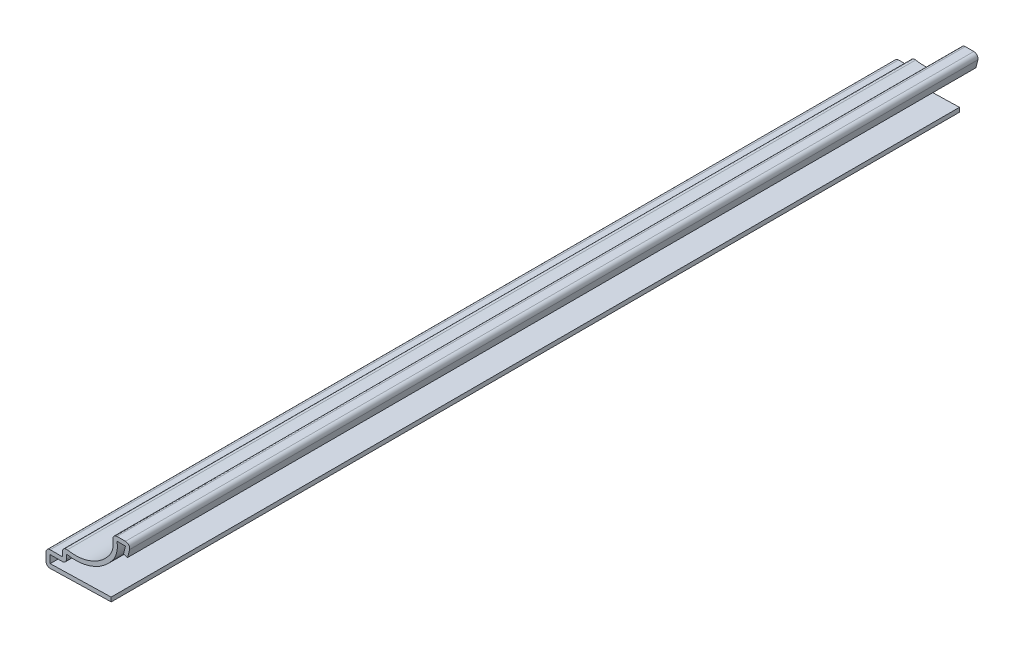
ISO-10303-21;
HEADER;
FILE_DESCRIPTION(('STEP AP214'),'2;1');
FILE_NAME('part.step','',(''),(''),'','','');
FILE_SCHEMA(('AUTOMOTIVE_DESIGN { 1 0 10303 214 1 1 1 1 }'));
ENDSEC;
DATA;
#1=APPLICATION_CONTEXT('core data for automotive mechanical design processes');
#2=APPLICATION_PROTOCOL_DEFINITION('international standard','automotive_design',2000,#1);
#3=PRODUCT_CONTEXT('',#1,'mechanical');
#4=PRODUCT('Part','Part','',(#3));
#5=PRODUCT_RELATED_PRODUCT_CATEGORY('part','',(#4));
#6=PRODUCT_DEFINITION_FORMATION('','',#4);
#7=PRODUCT_DEFINITION_CONTEXT('part definition',#1,'design');
#8=PRODUCT_DEFINITION('design','',#6,#7);
#9=PRODUCT_DEFINITION_SHAPE('','',#8);
#10=(LENGTH_UNIT() NAMED_UNIT(*) SI_UNIT(.MILLI.,.METRE.));
#11=(NAMED_UNIT(*) PLANE_ANGLE_UNIT() SI_UNIT($,.RADIAN.));
#12=(NAMED_UNIT(*) SI_UNIT($,.STERADIAN.) SOLID_ANGLE_UNIT());
#13=UNCERTAINTY_MEASURE_WITH_UNIT(LENGTH_MEASURE(1.E-05),#10,'distance_accuracy_value','');
#14=(GEOMETRIC_REPRESENTATION_CONTEXT(3) GLOBAL_UNCERTAINTY_ASSIGNED_CONTEXT((#13)) GLOBAL_UNIT_ASSIGNED_CONTEXT((#10,
#11,#12)) REPRESENTATION_CONTEXT('',''));
#15=CARTESIAN_POINT('',(0.,0.,0.));
#16=DIRECTION('',(0.,0.,1.));
#17=DIRECTION('',(1.,0.,0.));
#18=AXIS2_PLACEMENT_3D('',#15,#16,#17);
#19=CARTESIAN_POINT('',(-20.6375,0.,-206.375));
#20=DIRECTION('',(0.0249921911602031,-0.999687646408123,0.));
#21=DIRECTION('',(0.999687646408123,0.0249921911602031,0.));
#22=AXIS2_PLACEMENT_3D('',#19,#20,#21);
#23=PLANE('',#22);
#24=DIRECTION('',(0.999687646408123,0.0249921911602031,0.));
#25=VECTOR('',#24,1.);
#26=CARTESIAN_POINT('',(-20.6375,0.,0.));
#27=LINE('',#26,#25);
#28=CARTESIAN_POINT('',(-19.5961079337812,0.0260348016554691,0.));
#29=VERTEX_POINT('',#28);
#30=CARTESIAN_POINT('',(-4.7625,0.396875,0.));
#31=VERTEX_POINT('',#30);
#32=EDGE_CURVE('E360',#29,#31,#27,.T.);
#33=ORIENTED_EDGE('',*,*,#32,.F.);
#34=DIRECTION('',(0.,0.,1.));
#35=VECTOR('',#34,1.);
#36=CARTESIAN_POINT('',(-19.5961079337812,0.0260348016554691,-206.375));
#37=LINE('',#36,#35);
#38=CARTESIAN_POINT('',(-19.5961079337812,0.0260348016554691,-206.375));
#39=VERTEX_POINT('',#38);
#40=EDGE_CURVE('E205',#29,#39,#37,.F.);
#41=ORIENTED_EDGE('',*,*,#40,.T.);
#42=DIRECTION('',(0.999687646408123,0.0249921911602031,0.));
#43=VECTOR('',#42,1.);
#44=CARTESIAN_POINT('',(-20.6375,0.,-206.375));
#45=LINE('',#44,#43);
#46=CARTESIAN_POINT('',(-4.7625,0.396875,-206.375));
#47=VERTEX_POINT('',#46);
#48=EDGE_CURVE('E198',#39,#47,#45,.T.);
#49=ORIENTED_EDGE('',*,*,#48,.T.);
#50=DIRECTION('',(0.,0.,1.));
#51=VECTOR('',#50,1.);
#52=CARTESIAN_POINT('',(-4.7625,0.396875,-206.375));
#53=LINE('',#52,#51);
#54=EDGE_CURVE('E202',#47,#31,#53,.T.);
#55=ORIENTED_EDGE('',*,*,#54,.T.);
#56=EDGE_LOOP('',(#33,#41,#49,#55));
#57=FACE_BOUND('',#56,.T.);
#58=ADVANCED_FACE('F35',(#57),#23,.T.);
#59=CARTESIAN_POINT('',(-20.6375,3.96875,-206.375));
#60=DIRECTION('',(-1.,0.,0.));
#61=DIRECTION('',(0.,0.,1.));
#62=AXIS2_PLACEMENT_3D('',#59,#60,#61);
#63=PLANE('',#62);
#64=DIRECTION('',(0.,-1.,0.));
#65=VECTOR('',#64,1.);
#66=CARTESIAN_POINT('',(-20.6375,3.96875,-206.375));
#67=LINE('',#66,#65);
#68=CARTESIAN_POINT('',(-20.6375,2.95275,-206.375));
#69=VERTEX_POINT('',#68);
#70=CARTESIAN_POINT('',(-20.6375,1.04171745040612,-206.375));
#71=VERTEX_POINT('',#70);
#72=EDGE_CURVE('E222',#69,#71,#67,.T.);
#73=ORIENTED_EDGE('',*,*,#72,.T.);
#74=DIRECTION('',(0.,0.,1.));
#75=VECTOR('',#74,1.);
#76=CARTESIAN_POINT('',(-20.6375,1.04171745040612,-206.375));
#77=LINE('',#76,#75);
#78=CARTESIAN_POINT('',(-20.6375,1.04171745040612,0.));
#79=VERTEX_POINT('',#78);
#80=EDGE_CURVE('E233',#71,#79,#77,.T.);
#81=ORIENTED_EDGE('',*,*,#80,.T.);
#82=DIRECTION('',(0.,-1.,0.));
#83=VECTOR('',#82,1.);
#84=CARTESIAN_POINT('',(-20.6375,3.96875,0.));
#85=LINE('',#84,#83);
#86=CARTESIAN_POINT('',(-20.6375,2.95275,0.));
#87=VERTEX_POINT('',#86);
#88=EDGE_CURVE('E208',#87,#79,#85,.T.);
#89=ORIENTED_EDGE('',*,*,#88,.F.);
#90=DIRECTION('',(0.,0.,1.));
#91=VECTOR('',#90,1.);
#92=CARTESIAN_POINT('',(-20.6375,2.95275,-206.375));
#93=LINE('',#92,#91);
#94=EDGE_CURVE('E231',#87,#69,#93,.F.);
#95=ORIENTED_EDGE('',*,*,#94,.T.);
#96=EDGE_LOOP('',(#73,#81,#89,#95));
#97=FACE_BOUND('',#96,.T.);
#98=ADVANCED_FACE('F424',(#97),#63,.T.);
#99=CARTESIAN_POINT('',(-16.66875,3.96875,-206.375));
#100=DIRECTION('',(0.,1.,0.));
#101=DIRECTION('',(-1.,0.,0.));
#102=AXIS2_PLACEMENT_3D('',#99,#100,#101);
#103=PLANE('',#102);
#104=DIRECTION('',(-1.,0.,0.));
#105=VECTOR('',#104,1.);
#106=CARTESIAN_POINT('',(-16.66875,3.96875,-206.375));
#107=LINE('',#106,#105);
#108=CARTESIAN_POINT('',(-16.66875,3.96875,-206.375));
#109=VERTEX_POINT('',#108);
#110=CARTESIAN_POINT('',(-19.6215,3.96875,-206.375));
#111=VERTEX_POINT('',#110);
#112=EDGE_CURVE('E227',#109,#111,#107,.T.);
#113=ORIENTED_EDGE('',*,*,#112,.T.);
#114=DIRECTION('',(0.,0.,1.));
#115=VECTOR('',#114,1.);
#116=CARTESIAN_POINT('',(-19.6215,3.96875,-206.375));
#117=LINE('',#116,#115);
#118=CARTESIAN_POINT('',(-19.6215,3.96875,0.));
#119=VERTEX_POINT('',#118);
#120=EDGE_CURVE('E261',#111,#119,#117,.T.);
#121=ORIENTED_EDGE('',*,*,#120,.T.);
#122=DIRECTION('',(-1.,0.,0.));
#123=VECTOR('',#122,1.);
#124=CARTESIAN_POINT('',(-16.66875,3.96875,0.));
#125=LINE('',#124,#123);
#126=CARTESIAN_POINT('',(-16.66875,3.96875,0.));
#127=VERTEX_POINT('',#126);
#128=EDGE_CURVE('E319',#127,#119,#125,.T.);
#129=ORIENTED_EDGE('',*,*,#128,.F.);
#130=DIRECTION('',(0.,0.,1.));
#131=VECTOR('',#130,1.);
#132=CARTESIAN_POINT('',(-16.66875,3.96875,-206.375));
#133=LINE('',#132,#131);
#134=EDGE_CURVE('E234',#109,#127,#133,.T.);
#135=ORIENTED_EDGE('',*,*,#134,.F.);
#136=EDGE_LOOP('',(#113,#121,#129,#135));
#137=FACE_BOUND('',#136,.T.);
#138=ADVANCED_FACE('F434',(#137),#103,.T.);
#139=CARTESIAN_POINT('',(-16.66875,6.35,-206.375));
#140=DIRECTION('',(-1.,0.,0.));
#141=DIRECTION('',(0.,0.,1.));
#142=AXIS2_PLACEMENT_3D('',#139,#140,#141);
#143=PLANE('',#142);
#144=DIRECTION('',(0.,-1.,0.));
#145=VECTOR('',#144,1.);
#146=CARTESIAN_POINT('',(-16.66875,6.35,0.));
#147=LINE('',#146,#145);
#148=CARTESIAN_POINT('',(-16.66875,5.0409139638664,0.));
#149=VERTEX_POINT('',#148);
#150=EDGE_CURVE('E317',#149,#127,#147,.T.);
#151=ORIENTED_EDGE('',*,*,#150,.F.);
#152=DIRECTION('',(0.,0.,1.));
#153=VECTOR('',#152,1.);
#154=CARTESIAN_POINT('',(-16.66875,5.0409139638664,-206.375));
#155=LINE('',#154,#153);
#156=CARTESIAN_POINT('',(-16.66875,5.0409139638664,-206.375));
#157=VERTEX_POINT('',#156);
#158=EDGE_CURVE('E271',#149,#157,#155,.F.);
#159=ORIENTED_EDGE('',*,*,#158,.T.);
#160=DIRECTION('',(0.,-1.,0.));
#161=VECTOR('',#160,1.);
#162=CARTESIAN_POINT('',(-16.66875,6.35,-206.375));
#163=LINE('',#162,#161);
#164=EDGE_CURVE('E415',#157,#109,#163,.T.);
#165=ORIENTED_EDGE('',*,*,#164,.T.);
#166=ORIENTED_EDGE('',*,*,#134,.T.);
#167=EDGE_LOOP('',(#151,#159,#165,#166));
#168=FACE_BOUND('',#167,.T.);
#169=ADVANCED_FACE('F438',(#168),#143,.T.);
#170=CARTESIAN_POINT('',(-13.49375,16.1681452710021,-206.375));
#171=DIRECTION('',(0.,0.,1.));
#172=DIRECTION('',(1.,0.,0.));
#173=AXIS2_PLACEMENT_3D('',#170,#171,#172);
#174=CYLINDRICAL_SURFACE('',#173,10.31875);
#175=CARTESIAN_POINT('',(-13.49375,16.1681452710021,-206.375));
#176=DIRECTION('',(0.,0.,-1.));
#177=DIRECTION('',(-1.,0.,0.));
#178=AXIS2_PLACEMENT_3D('',#175,#176,#177);
#179=CIRCLE('',#178,10.31875);
#180=CARTESIAN_POINT('',(-5.2407693577414,9.97420370839389,-206.375));
#181=VERTEX_POINT('',#180);
#182=CARTESIAN_POINT('',(-15.4592261904762,6.03831284853962,-206.375));
#183=VERTEX_POINT('',#182);
#184=EDGE_CURVE('E292',#181,#183,#179,.T.);
#185=ORIENTED_EDGE('',*,*,#184,.T.);
#186=DIRECTION('',(0.,0.,1.));
#187=VECTOR('',#186,1.);
#188=CARTESIAN_POINT('',(-15.4592261904762,6.03831284853962,-206.375));
#189=LINE('',#188,#187);
#190=CARTESIAN_POINT('',(-15.4592261904762,6.03831284853962,0.));
#191=VERTEX_POINT('',#190);
#192=EDGE_CURVE('E268',#183,#191,#189,.T.);
#193=ORIENTED_EDGE('',*,*,#192,.T.);
#194=CARTESIAN_POINT('',(-13.49375,16.1681452710021,0.));
#195=DIRECTION('',(0.,0.,-1.));
#196=DIRECTION('',(-1.,0.,0.));
#197=AXIS2_PLACEMENT_3D('',#194,#195,#196);
#198=CIRCLE('',#197,10.31875);
#199=CARTESIAN_POINT('',(-5.2407693577414,9.97420370839389,0.));
#200=VERTEX_POINT('',#199);
#201=EDGE_CURVE('E309',#200,#191,#198,.T.);
#202=ORIENTED_EDGE('',*,*,#201,.F.);
#203=DIRECTION('',(0.,0.,1.));
#204=VECTOR('',#203,1.);
#205=CARTESIAN_POINT('',(-5.2407693577414,9.97420370839389,-206.375));
#206=LINE('',#205,#204);
#207=EDGE_CURVE('E325',#181,#200,#206,.T.);
#208=ORIENTED_EDGE('',*,*,#207,.F.);
#209=EDGE_LOOP('',(#185,#193,#202,#208));
#210=FACE_BOUND('',#209,.T.);
#211=ADVANCED_FACE('F446',(#210),#174,.F.);
#212=CARTESIAN_POINT('',(-9.04983734647614,12.8329459680592,-206.375));
#213=DIRECTION('',(0.,0.,1.));
#214=DIRECTION('',(1.,0.,0.));
#215=AXIS2_PLACEMENT_3D('',#212,#213,#214);
#216=CYLINDRICAL_SURFACE('',#215,4.7625);
#217=CARTESIAN_POINT('',(-9.04983734647614,12.8329459680592,0.));
#218=DIRECTION('',(0.,0.,-1.));
#219=DIRECTION('',(-1.,0.,0.));
#220=AXIS2_PLACEMENT_3D('',#217,#218,#219);
#221=CIRCLE('',#220,4.7625);
#222=CARTESIAN_POINT('',(-4.36779486000966,13.7046594559225,0.));
#223=VERTEX_POINT('',#222);
#224=EDGE_CURVE('E285',#223,#200,#221,.T.);
#225=ORIENTED_EDGE('',*,*,#224,.F.);
#226=DIRECTION('',(0.,0.,1.));
#227=VECTOR('',#226,1.);
#228=CARTESIAN_POINT('',(-4.36779486000966,13.7046594559225,-206.375));
#229=LINE('',#228,#227);
#230=CARTESIAN_POINT('',(-4.36779486000966,13.7046594559225,-206.375));
#231=VERTEX_POINT('',#230);
#232=EDGE_CURVE('E43',#223,#231,#229,.F.);
#233=ORIENTED_EDGE('',*,*,#232,.T.);
#234=CARTESIAN_POINT('',(-9.04983734647614,12.8329459680592,-206.375));
#235=DIRECTION('',(0.,0.,-1.));
#236=DIRECTION('',(-1.,0.,0.));
#237=AXIS2_PLACEMENT_3D('',#234,#235,#236);
#238=CIRCLE('',#237,4.7625);
#239=EDGE_CURVE('E283',#231,#181,#238,.T.);
#240=ORIENTED_EDGE('',*,*,#239,.T.);
#241=ORIENTED_EDGE('',*,*,#207,.T.);
#242=EDGE_LOOP('',(#225,#233,#240,#241));
#243=FACE_BOUND('',#242,.T.);
#244=ADVANCED_FACE('F281',(#243),#216,.F.);
#245=CARTESIAN_POINT('',(0.,14.906625,-206.375));
#246=DIRECTION('',(0.,1.,0.));
#247=DIRECTION('',(-1.,0.,0.));
#248=AXIS2_PLACEMENT_3D('',#245,#246,#247);
#249=PLANE('',#248);
#250=DIRECTION('',(-1.,0.,0.));
#251=VECTOR('',#250,1.);
#252=CARTESIAN_POINT('',(0.,14.906625,-206.375));
#253=LINE('',#252,#251);
#254=CARTESIAN_POINT('',(-1.30126882890688,14.906625,-206.375));
#255=VERTEX_POINT('',#254);
#256=CARTESIAN_POINT('',(-3.36895912956348,14.906625,-206.375));
#257=VERTEX_POINT('',#256);
#258=EDGE_CURVE('E293',#255,#257,#253,.T.);
#259=ORIENTED_EDGE('',*,*,#258,.T.);
#260=DIRECTION('',(0.,0.,1.));
#261=VECTOR('',#260,1.);
#262=CARTESIAN_POINT('',(-3.36895912956348,14.906625,-206.375));
#263=LINE('',#262,#261);
#264=CARTESIAN_POINT('',(-3.36895912956348,14.906625,0.));
#265=VERTEX_POINT('',#264);
#266=EDGE_CURVE('E275',#257,#265,#263,.T.);
#267=ORIENTED_EDGE('',*,*,#266,.T.);
#268=DIRECTION('',(-1.,0.,0.));
#269=VECTOR('',#268,1.);
#270=CARTESIAN_POINT('',(0.,14.906625,0.));
#271=LINE('',#270,#269);
#272=CARTESIAN_POINT('',(-1.30126882890688,14.906625,0.));
#273=VERTEX_POINT('',#272);
#274=EDGE_CURVE('E301',#273,#265,#271,.T.);
#275=ORIENTED_EDGE('',*,*,#274,.F.);
#276=DIRECTION('',(0.,0.,1.));
#277=VECTOR('',#276,1.);
#278=CARTESIAN_POINT('',(-1.30126882890689,14.906625,-206.375));
#279=LINE('',#278,#277);
#280=EDGE_CURVE('E273',#273,#255,#279,.F.);
#281=ORIENTED_EDGE('',*,*,#280,.T.);
#282=EDGE_LOOP('',(#259,#267,#275,#281));
#283=FACE_BOUND('',#282,.T.);
#284=ADVANCED_FACE('F300',(#283),#249,.T.);
#285=CARTESIAN_POINT('',(-0.79375,11.731625,-206.375));
#286=DIRECTION('',(0.970142500145332,-0.242535625036333,0.));
#287=DIRECTION('',(0.242535625036333,0.970142500145332,0.));
#288=AXIS2_PLACEMENT_3D('',#285,#286,#287);
#289=PLANE('',#288);
#290=DIRECTION('',(0.242535625036333,0.970142500145332,0.));
#291=VECTOR('',#290,1.);
#292=CARTESIAN_POINT('',(-0.79375,11.731625,-206.375));
#293=LINE('',#292,#291);
#294=CARTESIAN_POINT('',(-0.79375,11.731625,-206.375));
#295=VERTEX_POINT('',#294);
#296=CARTESIAN_POINT('',(-0.315604048759229,13.6442088049631,-206.375));
#297=VERTEX_POINT('',#296);
#298=EDGE_CURVE('E410',#295,#297,#293,.T.);
#299=ORIENTED_EDGE('',*,*,#298,.T.);
#300=DIRECTION('',(0.,0.,1.));
#301=VECTOR('',#300,1.);
#302=CARTESIAN_POINT('',(-0.315604048759229,13.6442088049631,-206.375));
#303=LINE('',#302,#301);
#304=CARTESIAN_POINT('',(-0.315604048759229,13.6442088049631,0.));
#305=VERTEX_POINT('',#304);
#306=EDGE_CURVE('E11',#297,#305,#303,.T.);
#307=ORIENTED_EDGE('',*,*,#306,.T.);
#308=DIRECTION('',(0.242535625036333,0.970142500145332,0.));
#309=VECTOR('',#308,1.);
#310=CARTESIAN_POINT('',(-0.79375,11.731625,0.));
#311=LINE('',#310,#309);
#312=CARTESIAN_POINT('',(-0.79375,11.731625,0.));
#313=VERTEX_POINT('',#312);
#314=EDGE_CURVE('E307',#313,#305,#311,.T.);
#315=ORIENTED_EDGE('',*,*,#314,.F.);
#316=DIRECTION('',(0.,0.,1.));
#317=VECTOR('',#316,1.);
#318=CARTESIAN_POINT('',(-0.79375,11.731625,-206.375));
#319=LINE('',#318,#317);
#320=EDGE_CURVE('E327',#295,#313,#319,.T.);
#321=ORIENTED_EDGE('',*,*,#320,.F.);
#322=EDGE_LOOP('',(#299,#307,#315,#321));
#323=FACE_BOUND('',#322,.T.);
#324=ADVANCED_FACE('F484',(#323),#289,.T.);
#325=CARTESIAN_POINT('',(-0.79375,11.731625,-206.375));
#326=DIRECTION('',(0.242535625036333,0.970142500145332,0.));
#327=DIRECTION('',(-0.970142500145332,0.242535625036333,0.));
#328=AXIS2_PLACEMENT_3D('',#325,#326,#327);
#329=PLANE('',#328);
#330=DIRECTION('',(-0.970142500145332,0.242535625036333,0.));
#331=VECTOR('',#330,1.);
#332=CARTESIAN_POINT('',(-0.79375,11.731625,0.));
#333=LINE('',#332,#331);
#334=CARTESIAN_POINT('',(-1.77941478014766,11.9780411950369,0.));
#335=VERTEX_POINT('',#334);
#336=EDGE_CURVE('E311',#313,#335,#333,.T.);
#337=ORIENTED_EDGE('',*,*,#336,.T.);
#338=DIRECTION('',(0.,0.,1.));
#339=VECTOR('',#338,1.);
#340=CARTESIAN_POINT('',(-1.77941478014766,11.9780411950369,-206.375));
#341=LINE('',#340,#339);
#342=CARTESIAN_POINT('',(-1.77941478014766,11.9780411950369,-206.375));
#343=VERTEX_POINT('',#342);
#344=EDGE_CURVE('E329',#343,#335,#341,.T.);
#345=ORIENTED_EDGE('',*,*,#344,.F.);
#346=DIRECTION('',(-0.970142500145332,0.242535625036333,0.));
#347=VECTOR('',#346,1.);
#348=CARTESIAN_POINT('',(-0.79375,11.731625,-206.375));
#349=LINE('',#348,#347);
#350=EDGE_CURVE('E408',#295,#343,#349,.T.);
#351=ORIENTED_EDGE('',*,*,#350,.F.);
#352=ORIENTED_EDGE('',*,*,#320,.T.);
#353=EDGE_LOOP('',(#337,#345,#351,#352));
#354=FACE_BOUND('',#353,.T.);
#355=ADVANCED_FACE('F377',(#354),#329,.F.);
#356=CARTESIAN_POINT('',(-1.77941478014766,11.9780411950369,-206.375));
#357=DIRECTION('',(0.970142500145332,-0.242535625036333,0.));
#358=DIRECTION('',(0.242535625036333,0.970142500145332,0.));
#359=AXIS2_PLACEMENT_3D('',#356,#357,#358);
#360=PLANE('',#359);
#361=DIRECTION('',(0.242535625036333,0.970142500145332,0.));
#362=VECTOR('',#361,1.);
#363=CARTESIAN_POINT('',(-1.77941478014766,11.9780411950369,0.));
#364=LINE('',#363,#362);
#365=CARTESIAN_POINT('',(-1.30126882890689,13.890625,0.));
#366=VERTEX_POINT('',#365);
#367=EDGE_CURVE('E373',#335,#366,#364,.T.);
#368=ORIENTED_EDGE('',*,*,#367,.T.);
#369=DIRECTION('',(0.,0.,1.));
#370=VECTOR('',#369,1.);
#371=CARTESIAN_POINT('',(-1.30126882890689,13.890625,-206.375));
#372=LINE('',#371,#370);
#373=CARTESIAN_POINT('',(-1.30126882890689,13.890625,-206.375));
#374=VERTEX_POINT('',#373);
#375=EDGE_CURVE('E332',#374,#366,#372,.T.);
#376=ORIENTED_EDGE('',*,*,#375,.F.);
#377=DIRECTION('',(0.242535625036333,0.970142500145332,0.));
#378=VECTOR('',#377,1.);
#379=CARTESIAN_POINT('',(-1.77941478014766,11.9780411950369,-206.375));
#380=LINE('',#379,#378);
#381=EDGE_CURVE('E385',#343,#374,#380,.T.);
#382=ORIENTED_EDGE('',*,*,#381,.F.);
#383=ORIENTED_EDGE('',*,*,#344,.T.);
#384=EDGE_LOOP('',(#368,#376,#382,#383));
#385=FACE_BOUND('',#384,.T.);
#386=ADVANCED_FACE('F383',(#385),#360,.F.);
#387=CARTESIAN_POINT('',(0.,13.890625,-206.375));
#388=DIRECTION('',(0.,1.,0.));
#389=DIRECTION('',(-1.,0.,0.));
#390=AXIS2_PLACEMENT_3D('',#387,#388,#389);
#391=PLANE('',#390);
#392=DIRECTION('',(-1.,0.,0.));
#393=VECTOR('',#392,1.);
#394=CARTESIAN_POINT('',(0.,13.890625,0.));
#395=LINE('',#394,#393);
#396=CARTESIAN_POINT('',(-3.36895912956348,13.890625,0.));
#397=VERTEX_POINT('',#396);
#398=EDGE_CURVE('E371',#366,#397,#395,.T.);
#399=ORIENTED_EDGE('',*,*,#398,.T.);
#400=DIRECTION('',(0.,0.,1.));
#401=VECTOR('',#400,1.);
#402=CARTESIAN_POINT('',(-3.36895912956348,13.890625,-206.375));
#403=LINE('',#402,#401);
#404=CARTESIAN_POINT('',(-3.36895912956348,13.890625,-206.375));
#405=VERTEX_POINT('',#404);
#406=EDGE_CURVE('E335',#405,#397,#403,.T.);
#407=ORIENTED_EDGE('',*,*,#406,.F.);
#408=DIRECTION('',(-1.,0.,0.));
#409=VECTOR('',#408,1.);
#410=CARTESIAN_POINT('',(0.,13.890625,-206.375));
#411=LINE('',#410,#409);
#412=EDGE_CURVE('E399',#374,#405,#411,.T.);
#413=ORIENTED_EDGE('',*,*,#412,.F.);
#414=ORIENTED_EDGE('',*,*,#375,.T.);
#415=EDGE_LOOP('',(#399,#407,#413,#414));
#416=FACE_BOUND('',#415,.T.);
#417=ADVANCED_FACE('F391',(#416),#391,.F.);
#418=CARTESIAN_POINT('',(-9.04983734647614,12.8329459680592,-206.375));
#419=DIRECTION('',(0.,0.,1.));
#420=DIRECTION('',(1.,0.,0.));
#421=AXIS2_PLACEMENT_3D('',#418,#419,#420);
#422=CYLINDRICAL_SURFACE('',#421,5.7785);
#423=CARTESIAN_POINT('',(-9.04983734647614,12.8329459680592,0.));
#424=DIRECTION('',(0.,0.,1.));
#425=DIRECTION('',(1.,0.,0.));
#426=AXIS2_PLACEMENT_3D('',#423,#424,#425);
#427=CIRCLE('',#426,5.7785);
#428=CARTESIAN_POINT('',(-4.42816818681133,9.36433869299862,0.));
#429=VERTEX_POINT('',#428);
#430=EDGE_CURVE('E369',#397,#429,#427,.F.);
#431=ORIENTED_EDGE('',*,*,#430,.T.);
#432=DIRECTION('',(0.,0.,1.));
#433=VECTOR('',#432,1.);
#434=CARTESIAN_POINT('',(-4.42816818681133,9.36433869299862,-206.375));
#435=LINE('',#434,#433);
#436=CARTESIAN_POINT('',(-4.42816818681133,9.36433869299862,-206.375));
#437=VERTEX_POINT('',#436);
#438=EDGE_CURVE('E338',#437,#429,#435,.T.);
#439=ORIENTED_EDGE('',*,*,#438,.F.);
#440=CARTESIAN_POINT('',(-9.04983734647614,12.8329459680592,-206.375));
#441=DIRECTION('',(0.,0.,1.));
#442=DIRECTION('',(1.,0.,0.));
#443=AXIS2_PLACEMENT_3D('',#440,#441,#442);
#444=CIRCLE('',#443,5.7785);
#445=EDGE_CURVE('E397',#405,#437,#444,.F.);
#446=ORIENTED_EDGE('',*,*,#445,.F.);
#447=ORIENTED_EDGE('',*,*,#406,.T.);
#448=EDGE_LOOP('',(#431,#439,#446,#447));
#449=FACE_BOUND('',#448,.T.);
#450=ADVANCED_FACE('F395',(#449),#422,.T.);
#451=CARTESIAN_POINT('',(-13.49375,16.1681452710021,-206.375));
#452=DIRECTION('',(0.,0.,1.));
#453=DIRECTION('',(1.,0.,0.));
#454=AXIS2_PLACEMENT_3D('',#451,#452,#453);
#455=CYLINDRICAL_SURFACE('',#454,11.33475);
#456=CARTESIAN_POINT('',(-13.49375,16.1681452710021,0.));
#457=DIRECTION('',(0.,0.,1.));
#458=DIRECTION('',(1.,0.,0.));
#459=AXIS2_PLACEMENT_3D('',#456,#457,#458);
#460=CIRCLE('',#459,11.33475);
#461=CARTESIAN_POINT('',(-15.65275,5.0409139638664,0.));
#462=VERTEX_POINT('',#461);
#463=EDGE_CURVE('E367',#429,#462,#460,.F.);
#464=ORIENTED_EDGE('',*,*,#463,.T.);
#465=DIRECTION('',(0.,0.,1.));
#466=VECTOR('',#465,1.);
#467=CARTESIAN_POINT('',(-15.65275,5.0409139638664,-206.375));
#468=LINE('',#467,#466);
#469=CARTESIAN_POINT('',(-15.65275,5.0409139638664,-206.375));
#470=VERTEX_POINT('',#469);
#471=EDGE_CURVE('E341',#470,#462,#468,.T.);
#472=ORIENTED_EDGE('',*,*,#471,.F.);
#473=CARTESIAN_POINT('',(-13.49375,16.1681452710021,-206.375));
#474=DIRECTION('',(0.,0.,1.));
#475=DIRECTION('',(1.,0.,0.));
#476=AXIS2_PLACEMENT_3D('',#473,#474,#475);
#477=CIRCLE('',#476,11.33475);
#478=EDGE_CURVE('E400',#437,#470,#477,.F.);
#479=ORIENTED_EDGE('',*,*,#478,.F.);
#480=ORIENTED_EDGE('',*,*,#438,.T.);
#481=EDGE_LOOP('',(#464,#472,#479,#480));
#482=FACE_BOUND('',#481,.T.);
#483=ADVANCED_FACE('F500',(#482),#455,.T.);
#484=CARTESIAN_POINT('',(-15.65275,6.35,-206.375));
#485=DIRECTION('',(-1.,0.,0.));
#486=DIRECTION('',(0.,0.,1.));
#487=AXIS2_PLACEMENT_3D('',#484,#485,#486);
#488=PLANE('',#487);
#489=DIRECTION('',(0.,1.,0.));
#490=VECTOR('',#489,1.);
#491=CARTESIAN_POINT('',(-15.65275,6.35,0.));
#492=LINE('',#491,#490);
#493=CARTESIAN_POINT('',(-15.65275,3.96875,0.));
#494=VERTEX_POINT('',#493);
#495=EDGE_CURVE('E365',#462,#494,#492,.F.);
#496=ORIENTED_EDGE('',*,*,#495,.T.);
#497=DIRECTION('',(0.,0.,1.));
#498=VECTOR('',#497,1.);
#499=CARTESIAN_POINT('',(-15.65275,3.96875,-206.375));
#500=LINE('',#499,#498);
#501=CARTESIAN_POINT('',(-15.65275,3.96875,-206.375));
#502=VERTEX_POINT('',#501);
#503=EDGE_CURVE('E58',#494,#502,#500,.F.);
#504=ORIENTED_EDGE('',*,*,#503,.T.);
#505=DIRECTION('',(0.,1.,0.));
#506=VECTOR('',#505,1.);
#507=CARTESIAN_POINT('',(-15.65275,6.35,-206.375));
#508=LINE('',#507,#506);
#509=EDGE_CURVE('E403',#470,#502,#508,.F.);
#510=ORIENTED_EDGE('',*,*,#509,.F.);
#511=ORIENTED_EDGE('',*,*,#471,.T.);
#512=EDGE_LOOP('',(#496,#504,#510,#511));
#513=FACE_BOUND('',#512,.T.);
#514=ADVANCED_FACE('F503',(#513),#488,.F.);
#515=CARTESIAN_POINT('',(-16.66875,2.95275,-206.375));
#516=DIRECTION('',(0.,1.,0.));
#517=DIRECTION('',(-1.,0.,0.));
#518=AXIS2_PLACEMENT_3D('',#515,#516,#517);
#519=PLANE('',#518);
#520=DIRECTION('',(-1.,0.,0.));
#521=VECTOR('',#520,1.);
#522=CARTESIAN_POINT('',(-16.66875,2.95275,-206.375));
#523=LINE('',#522,#521);
#524=CARTESIAN_POINT('',(-16.66875,2.95275,-206.375));
#525=VERTEX_POINT('',#524);
#526=CARTESIAN_POINT('',(-19.6215,2.95275,-206.375));
#527=VERTEX_POINT('',#526);
#528=EDGE_CURVE('E671',#525,#527,#523,.T.);
#529=ORIENTED_EDGE('',*,*,#528,.F.);
#530=DIRECTION('',(0.,0.,1.));
#531=VECTOR('',#530,1.);
#532=CARTESIAN_POINT('',(-16.66875,2.95275,-206.375));
#533=LINE('',#532,#531);
#534=CARTESIAN_POINT('',(-16.66875,2.95275,0.));
#535=VERTEX_POINT('',#534);
#536=EDGE_CURVE('E264',#525,#535,#533,.T.);
#537=ORIENTED_EDGE('',*,*,#536,.T.);
#538=DIRECTION('',(-1.,0.,0.));
#539=VECTOR('',#538,1.);
#540=CARTESIAN_POINT('',(-16.66875,2.95275,0.));
#541=LINE('',#540,#539);
#542=CARTESIAN_POINT('',(-19.6215,2.95275,0.));
#543=VERTEX_POINT('',#542);
#544=EDGE_CURVE('E358',#535,#543,#541,.T.);
#545=ORIENTED_EDGE('',*,*,#544,.T.);
#546=DIRECTION('',(0.,0.,1.));
#547=VECTOR('',#546,1.);
#548=CARTESIAN_POINT('',(-19.6215,2.95275,-206.375));
#549=LINE('',#548,#547);
#550=EDGE_CURVE('E344',#527,#543,#549,.T.);
#551=ORIENTED_EDGE('',*,*,#550,.F.);
#552=EDGE_LOOP('',(#529,#537,#545,#551));
#553=FACE_BOUND('',#552,.T.);
#554=ADVANCED_FACE('F507',(#553),#519,.F.);
#555=CARTESIAN_POINT('',(-19.6215,3.96875,-206.375));
#556=DIRECTION('',(-1.,0.,0.));
#557=DIRECTION('',(0.,0.,1.));
#558=AXIS2_PLACEMENT_3D('',#555,#556,#557);
#559=PLANE('',#558);
#560=DIRECTION('',(0.,1.,0.));
#561=VECTOR('',#560,1.);
#562=CARTESIAN_POINT('',(-19.6215,3.96875,0.));
#563=LINE('',#562,#561);
#564=CARTESIAN_POINT('',(-19.6215,1.04171745040612,0.));
#565=VERTEX_POINT('',#564);
#566=EDGE_CURVE('E356',#543,#565,#563,.F.);
#567=ORIENTED_EDGE('',*,*,#566,.T.);
#568=DIRECTION('',(0.,0.,1.));
#569=VECTOR('',#568,1.);
#570=CARTESIAN_POINT('',(-19.6215,1.04171745040612,-206.375));
#571=LINE('',#570,#569);
#572=CARTESIAN_POINT('',(-19.6215,1.04171745040612,-206.375));
#573=VERTEX_POINT('',#572);
#574=EDGE_CURVE('E224',#573,#565,#571,.T.);
#575=ORIENTED_EDGE('',*,*,#574,.F.);
#576=DIRECTION('',(0.,1.,0.));
#577=VECTOR('',#576,1.);
#578=CARTESIAN_POINT('',(-19.6215,3.96875,-206.375));
#579=LINE('',#578,#577);
#580=EDGE_CURVE('E670',#527,#573,#579,.F.);
#581=ORIENTED_EDGE('',*,*,#580,.F.);
#582=ORIENTED_EDGE('',*,*,#550,.T.);
#583=EDGE_LOOP('',(#567,#575,#581,#582));
#584=FACE_BOUND('',#583,.T.);
#585=ADVANCED_FACE('F510',(#584),#559,.F.);
#586=CARTESIAN_POINT('',(-20.6628920662188,1.01568264875065,-206.375));
#587=DIRECTION('',(0.0249921911602031,-0.999687646408123,0.));
#588=DIRECTION('',(0.999687646408123,0.0249921911602031,0.));
#589=AXIS2_PLACEMENT_3D('',#586,#587,#588);
#590=PLANE('',#589);
#591=DIRECTION('',(0.999687646408123,0.0249921911602031,0.));
#592=VECTOR('',#591,1.);
#593=CARTESIAN_POINT('',(-20.6628920662188,1.01568264875065,0.));
#594=LINE('',#593,#592);
#595=CARTESIAN_POINT('',(-4.78789206621876,1.41255764875065,0.));
#596=VERTEX_POINT('',#595);
#597=EDGE_CURVE('E351',#565,#596,#594,.T.);
#598=ORIENTED_EDGE('',*,*,#597,.T.);
#599=DIRECTION('',(0.,0.,1.));
#600=VECTOR('',#599,1.);
#601=CARTESIAN_POINT('',(-4.78789206621876,1.41255764875065,-206.375));
#602=LINE('',#601,#600);
#603=CARTESIAN_POINT('',(-4.78789206621876,1.41255764875065,-206.375));
#604=VERTEX_POINT('',#603);
#605=EDGE_CURVE('E221',#604,#596,#602,.T.);
#606=ORIENTED_EDGE('',*,*,#605,.F.);
#607=DIRECTION('',(0.999687646408123,0.0249921911602031,0.));
#608=VECTOR('',#607,1.);
#609=CARTESIAN_POINT('',(-20.6628920662188,1.01568264875065,-206.375));
#610=LINE('',#609,#608);
#611=EDGE_CURVE('E213',#573,#604,#610,.T.);
#612=ORIENTED_EDGE('',*,*,#611,.F.);
#613=ORIENTED_EDGE('',*,*,#574,.T.);
#614=EDGE_LOOP('',(#598,#606,#612,#613));
#615=FACE_BOUND('',#614,.T.);
#616=ADVANCED_FACE('F350',(#615),#590,.F.);
#617=CARTESIAN_POINT('',(-4.78789206621876,1.41255764875065,-206.375));
#618=DIRECTION('',(-0.999687646408123,-0.0249921911601956,0.));
#619=DIRECTION('',(0.0249921911601956,-0.999687646408123,0.));
#620=AXIS2_PLACEMENT_3D('',#617,#618,#619);
#621=PLANE('',#620);
#622=DIRECTION('',(0.0249921911601956,-0.999687646408123,0.));
#623=VECTOR('',#622,1.);
#624=CARTESIAN_POINT('',(-4.78789206621876,1.41255764875065,0.));
#625=LINE('',#624,#623);
#626=EDGE_CURVE('E220',#596,#31,#625,.T.);
#627=ORIENTED_EDGE('',*,*,#626,.T.);
#628=ORIENTED_EDGE('',*,*,#54,.F.);
#629=DIRECTION('',(0.0249921911601956,-0.999687646408123,0.));
#630=VECTOR('',#629,1.);
#631=CARTESIAN_POINT('',(-4.78789206621876,1.41255764875065,-206.375));
#632=LINE('',#631,#630);
#633=EDGE_CURVE('E207',#604,#47,#632,.T.);
#634=ORIENTED_EDGE('',*,*,#633,.F.);
#635=ORIENTED_EDGE('',*,*,#605,.T.);
#636=EDGE_LOOP('',(#627,#628,#634,#635));
#637=FACE_BOUND('',#636,.T.);
#638=ADVANCED_FACE('F218',(#637),#621,.F.);
#639=CARTESIAN_POINT('',(-13.49375,16.1681452710021,-206.375));
#640=DIRECTION('',(0.,0.,1.));
#641=DIRECTION('',(1.,0.,0.));
#642=AXIS2_PLACEMENT_3D('',#639,#640,#641);
#643=PLANE('',#642);
#644=ORIENTED_EDGE('',*,*,#48,.F.);
#645=CARTESIAN_POINT('',(-19.6215,1.04171745040612,-206.375));
#646=DIRECTION('',(0.,0.,1.));
#647=DIRECTION('',(1.,0.,0.));
#648=AXIS2_PLACEMENT_3D('',#645,#646,#647);
#649=CIRCLE('',#648,1.016);
#650=EDGE_CURVE('E259',#39,#71,#649,.F.);
#651=ORIENTED_EDGE('',*,*,#650,.T.);
#652=ORIENTED_EDGE('',*,*,#72,.F.);
#653=CARTESIAN_POINT('',(-19.6215,2.95275,-206.375));
#654=DIRECTION('',(0.,0.,1.));
#655=DIRECTION('',(1.,0.,0.));
#656=AXIS2_PLACEMENT_3D('',#653,#654,#655);
#657=CIRCLE('',#656,1.016);
#658=EDGE_CURVE('E257',#69,#111,#657,.F.);
#659=ORIENTED_EDGE('',*,*,#658,.T.);
#660=ORIENTED_EDGE('',*,*,#112,.F.);
#661=ORIENTED_EDGE('',*,*,#164,.F.);
#662=CARTESIAN_POINT('',(-15.65275,5.0409139638664,-206.375));
#663=DIRECTION('',(0.,0.,1.));
#664=DIRECTION('',(1.,0.,0.));
#665=AXIS2_PLACEMENT_3D('',#662,#663,#664);
#666=CIRCLE('',#665,1.016);
#667=EDGE_CURVE('E254',#157,#183,#666,.F.);
#668=ORIENTED_EDGE('',*,*,#667,.T.);
#669=ORIENTED_EDGE('',*,*,#184,.F.);
#670=ORIENTED_EDGE('',*,*,#239,.F.);
#671=CARTESIAN_POINT('',(-3.36895912956348,13.890625,-206.375));
#672=DIRECTION('',(0.,0.,1.));
#673=DIRECTION('',(1.,0.,0.));
#674=AXIS2_PLACEMENT_3D('',#671,#672,#673);
#675=CIRCLE('',#674,1.016);
#676=EDGE_CURVE('E252',#231,#257,#675,.F.);
#677=ORIENTED_EDGE('',*,*,#676,.T.);
#678=ORIENTED_EDGE('',*,*,#258,.F.);
#679=CARTESIAN_POINT('',(-1.30126882890689,13.890625,-206.375));
#680=DIRECTION('',(0.,0.,1.));
#681=DIRECTION('',(1.,0.,0.));
#682=AXIS2_PLACEMENT_3D('',#679,#680,#681);
#683=CIRCLE('',#682,1.016);
#684=EDGE_CURVE('E250',#255,#297,#683,.F.);
#685=ORIENTED_EDGE('',*,*,#684,.T.);
#686=ORIENTED_EDGE('',*,*,#298,.F.);
#687=ORIENTED_EDGE('',*,*,#350,.T.);
#688=ORIENTED_EDGE('',*,*,#381,.T.);
#689=ORIENTED_EDGE('',*,*,#412,.T.);
#690=ORIENTED_EDGE('',*,*,#445,.T.);
#691=ORIENTED_EDGE('',*,*,#478,.T.);
#692=ORIENTED_EDGE('',*,*,#509,.T.);
#693=CARTESIAN_POINT('',(-16.66875,3.96875,-206.375));
#694=DIRECTION('',(0.,0.,1.));
#695=DIRECTION('',(1.,0.,0.));
#696=AXIS2_PLACEMENT_3D('',#693,#694,#695);
#697=CIRCLE('',#696,1.016);
#698=EDGE_CURVE('E50',#502,#525,#697,.F.);
#699=ORIENTED_EDGE('',*,*,#698,.T.);
#700=ORIENTED_EDGE('',*,*,#528,.T.);
#701=ORIENTED_EDGE('',*,*,#580,.T.);
#702=ORIENTED_EDGE('',*,*,#611,.T.);
#703=ORIENTED_EDGE('',*,*,#633,.T.);
#704=EDGE_LOOP('',(#644,#651,#652,#659,#660,#661,#668,#669,#670,#677,#678,#685,#686,#687,#688,
#689,#690,#691,#692,#699,#700,#701,#702,#703));
#705=FACE_BOUND('',#704,.T.);
#706=ADVANCED_FACE('F211',(#705),#643,.F.);
#707=CARTESIAN_POINT('',(-13.49375,16.1681452710021,0.));
#708=DIRECTION('',(0.,0.,1.));
#709=DIRECTION('',(1.,0.,0.));
#710=AXIS2_PLACEMENT_3D('',#707,#708,#709);
#711=PLANE('',#710);
#712=ORIENTED_EDGE('',*,*,#88,.T.);
#713=CARTESIAN_POINT('',(-19.6215,1.04171745040612,0.));
#714=DIRECTION('',(0.,0.,1.));
#715=DIRECTION('',(1.,0.,0.));
#716=AXIS2_PLACEMENT_3D('',#713,#714,#715);
#717=CIRCLE('',#716,1.016);
#718=EDGE_CURVE('E247',#79,#29,#717,.T.);
#719=ORIENTED_EDGE('',*,*,#718,.T.);
#720=ORIENTED_EDGE('',*,*,#32,.T.);
#721=ORIENTED_EDGE('',*,*,#626,.F.);
#722=ORIENTED_EDGE('',*,*,#597,.F.);
#723=ORIENTED_EDGE('',*,*,#566,.F.);
#724=ORIENTED_EDGE('',*,*,#544,.F.);
#725=CARTESIAN_POINT('',(-16.66875,3.96875,0.));
#726=DIRECTION('',(0.,0.,1.));
#727=DIRECTION('',(1.,0.,0.));
#728=AXIS2_PLACEMENT_3D('',#725,#726,#727);
#729=CIRCLE('',#728,1.016);
#730=EDGE_CURVE('E243',#535,#494,#729,.T.);
#731=ORIENTED_EDGE('',*,*,#730,.T.);
#732=ORIENTED_EDGE('',*,*,#495,.F.);
#733=ORIENTED_EDGE('',*,*,#463,.F.);
#734=ORIENTED_EDGE('',*,*,#430,.F.);
#735=ORIENTED_EDGE('',*,*,#398,.F.);
#736=ORIENTED_EDGE('',*,*,#367,.F.);
#737=ORIENTED_EDGE('',*,*,#336,.F.);
#738=ORIENTED_EDGE('',*,*,#314,.T.);
#739=CARTESIAN_POINT('',(-1.30126882890689,13.890625,0.));
#740=DIRECTION('',(0.,0.,1.));
#741=DIRECTION('',(1.,0.,0.));
#742=AXIS2_PLACEMENT_3D('',#739,#740,#741);
#743=CIRCLE('',#742,1.016);
#744=EDGE_CURVE('E237',#305,#273,#743,.T.);
#745=ORIENTED_EDGE('',*,*,#744,.T.);
#746=ORIENTED_EDGE('',*,*,#274,.T.);
#747=CARTESIAN_POINT('',(-3.36895912956348,13.890625,0.));
#748=DIRECTION('',(0.,0.,1.));
#749=DIRECTION('',(1.,0.,0.));
#750=AXIS2_PLACEMENT_3D('',#747,#748,#749);
#751=CIRCLE('',#750,1.016);
#752=EDGE_CURVE('E239',#265,#223,#751,.T.);
#753=ORIENTED_EDGE('',*,*,#752,.T.);
#754=ORIENTED_EDGE('',*,*,#224,.T.);
#755=ORIENTED_EDGE('',*,*,#201,.T.);
#756=CARTESIAN_POINT('',(-15.65275,5.0409139638664,0.));
#757=DIRECTION('',(0.,0.,1.));
#758=DIRECTION('',(1.,0.,0.));
#759=AXIS2_PLACEMENT_3D('',#756,#757,#758);
#760=CIRCLE('',#759,1.016);
#761=EDGE_CURVE('E241',#191,#149,#760,.T.);
#762=ORIENTED_EDGE('',*,*,#761,.T.);
#763=ORIENTED_EDGE('',*,*,#150,.T.);
#764=ORIENTED_EDGE('',*,*,#128,.T.);
#765=CARTESIAN_POINT('',(-19.6215,2.95275,0.));
#766=DIRECTION('',(0.,0.,1.));
#767=DIRECTION('',(1.,0.,0.));
#768=AXIS2_PLACEMENT_3D('',#765,#766,#767);
#769=CIRCLE('',#768,1.016);
#770=EDGE_CURVE('E245',#119,#87,#769,.T.);
#771=ORIENTED_EDGE('',*,*,#770,.T.);
#772=EDGE_LOOP('',(#712,#719,#720,#721,#722,#723,#724,#731,#732,#733,#734,#735,#736,#737,#738,
#745,#746,#753,#754,#755,#762,#763,#764,#771));
#773=FACE_BOUND('',#772,.T.);
#774=ADVANCED_FACE('F305',(#773),#711,.T.);
#775=CARTESIAN_POINT('',(-19.6215,1.04171745040612,-206.375));
#776=DIRECTION('',(0.,0.,1.));
#777=DIRECTION('',(1.,0.,0.));
#778=AXIS2_PLACEMENT_3D('',#775,#776,#777);
#779=CYLINDRICAL_SURFACE('',#778,1.016);
#780=ORIENTED_EDGE('',*,*,#650,.F.);
#781=ORIENTED_EDGE('',*,*,#40,.F.);
#782=ORIENTED_EDGE('',*,*,#718,.F.);
#783=ORIENTED_EDGE('',*,*,#80,.F.);
#784=EDGE_LOOP('',(#780,#781,#782,#783));
#785=FACE_BOUND('',#784,.T.);
#786=ADVANCED_FACE('F419',(#785),#779,.T.);
#787=CARTESIAN_POINT('',(-19.6215,2.95275,-206.375));
#788=DIRECTION('',(0.,0.,1.));
#789=DIRECTION('',(1.,0.,0.));
#790=AXIS2_PLACEMENT_3D('',#787,#788,#789);
#791=CYLINDRICAL_SURFACE('',#790,1.016);
#792=ORIENTED_EDGE('',*,*,#658,.F.);
#793=ORIENTED_EDGE('',*,*,#94,.F.);
#794=ORIENTED_EDGE('',*,*,#770,.F.);
#795=ORIENTED_EDGE('',*,*,#120,.F.);
#796=EDGE_LOOP('',(#792,#793,#794,#795));
#797=FACE_BOUND('',#796,.T.);
#798=ADVANCED_FACE('F428',(#797),#791,.T.);
#799=CARTESIAN_POINT('',(-16.66875,3.96875,-206.375));
#800=DIRECTION('',(0.,0.,1.));
#801=DIRECTION('',(1.,0.,0.));
#802=AXIS2_PLACEMENT_3D('',#799,#800,#801);
#803=CYLINDRICAL_SURFACE('',#802,1.016);
#804=ORIENTED_EDGE('',*,*,#698,.F.);
#805=ORIENTED_EDGE('',*,*,#503,.F.);
#806=ORIENTED_EDGE('',*,*,#730,.F.);
#807=ORIENTED_EDGE('',*,*,#536,.F.);
#808=EDGE_LOOP('',(#804,#805,#806,#807));
#809=FACE_BOUND('',#808,.T.);
#810=ADVANCED_FACE('F468',(#809),#803,.T.);
#811=CARTESIAN_POINT('',(-15.65275,5.0409139638664,-206.375));
#812=DIRECTION('',(0.,0.,1.));
#813=DIRECTION('',(1.,0.,0.));
#814=AXIS2_PLACEMENT_3D('',#811,#812,#813);
#815=CYLINDRICAL_SURFACE('',#814,1.016);
#816=ORIENTED_EDGE('',*,*,#667,.F.);
#817=ORIENTED_EDGE('',*,*,#158,.F.);
#818=ORIENTED_EDGE('',*,*,#761,.F.);
#819=ORIENTED_EDGE('',*,*,#192,.F.);
#820=EDGE_LOOP('',(#816,#817,#818,#819));
#821=FACE_BOUND('',#820,.T.);
#822=ADVANCED_FACE('F443',(#821),#815,.T.);
#823=CARTESIAN_POINT('',(-3.36895912956348,13.890625,-206.375));
#824=DIRECTION('',(0.,0.,1.));
#825=DIRECTION('',(1.,0.,0.));
#826=AXIS2_PLACEMENT_3D('',#823,#824,#825);
#827=CYLINDRICAL_SURFACE('',#826,1.016);
#828=ORIENTED_EDGE('',*,*,#676,.F.);
#829=ORIENTED_EDGE('',*,*,#232,.F.);
#830=ORIENTED_EDGE('',*,*,#752,.F.);
#831=ORIENTED_EDGE('',*,*,#266,.F.);
#832=EDGE_LOOP('',(#828,#829,#830,#831));
#833=FACE_BOUND('',#832,.T.);
#834=ADVANCED_FACE('F296',(#833),#827,.T.);
#835=CARTESIAN_POINT('',(-1.30126882890689,13.890625,-206.375));
#836=DIRECTION('',(0.,0.,1.));
#837=DIRECTION('',(1.,0.,0.));
#838=AXIS2_PLACEMENT_3D('',#835,#836,#837);
#839=CYLINDRICAL_SURFACE('',#838,1.016);
#840=ORIENTED_EDGE('',*,*,#684,.F.);
#841=ORIENTED_EDGE('',*,*,#280,.F.);
#842=ORIENTED_EDGE('',*,*,#744,.F.);
#843=ORIENTED_EDGE('',*,*,#306,.F.);
#844=EDGE_LOOP('',(#840,#841,#842,#843));
#845=FACE_BOUND('',#844,.T.);
#846=ADVANCED_FACE('F37',(#845),#839,.T.);
#847=CLOSED_SHELL('',(#58,#98,#138,#169,#211,#244,#284,#324,#355,#386,#417,#450,#483,#514,#554,
#585,#616,#638,#706,#774,#786,#798,#810,#822,#834,#846));
#848=MANIFOLD_SOLID_BREP('B2',#847);
#849=ADVANCED_BREP_SHAPE_REPRESENTATION('',(#18,#848),#14);
#850=SHAPE_DEFINITION_REPRESENTATION(#9,#849);
ENDSEC;
END-ISO-10303-21;
